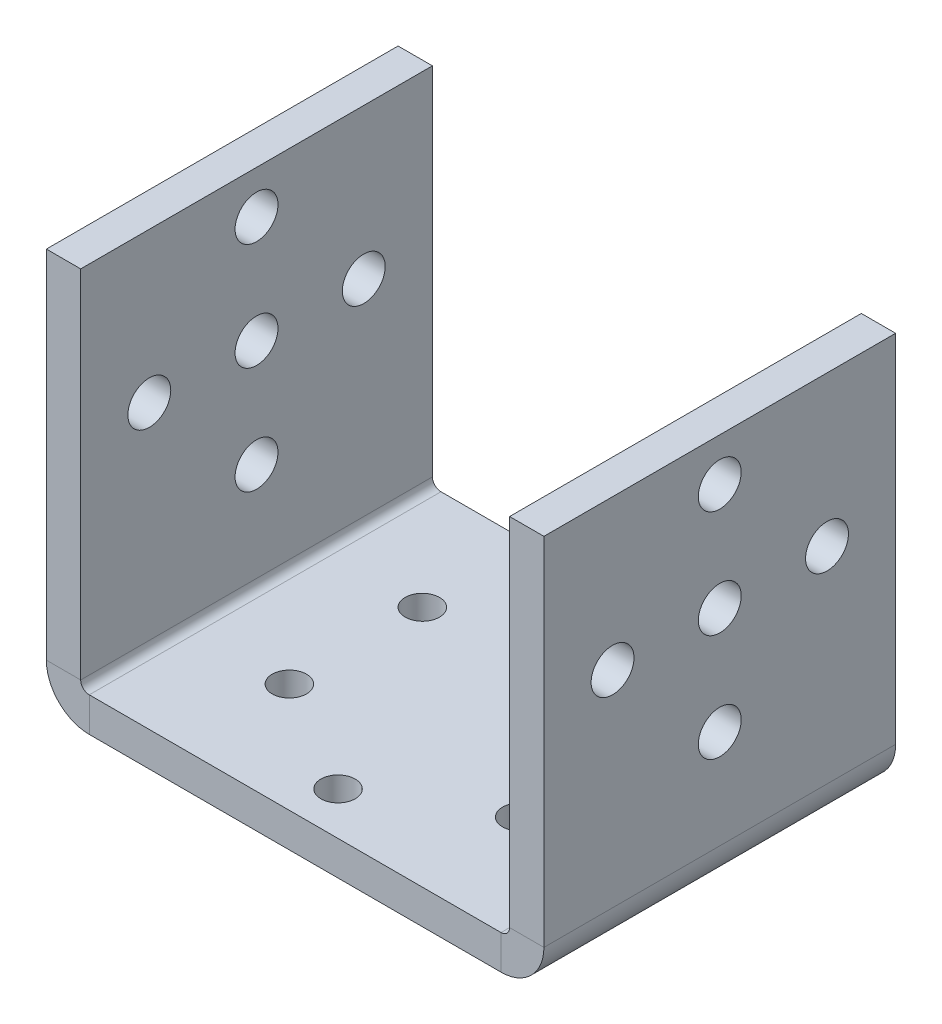
ISO-10303-21;
HEADER;
FILE_DESCRIPTION(('STEP AP214'),'2;1');
FILE_NAME('part.step','',(''),(''),'','','');
FILE_SCHEMA(('AUTOMOTIVE_DESIGN { 1 0 10303 214 1 1 1 1 }'));
ENDSEC;
DATA;
#1=APPLICATION_CONTEXT('core data for automotive mechanical design processes');
#2=APPLICATION_PROTOCOL_DEFINITION('international standard','automotive_design',2000,#1);
#3=PRODUCT_CONTEXT('',#1,'mechanical');
#4=PRODUCT('Part','Part','',(#3));
#5=PRODUCT_RELATED_PRODUCT_CATEGORY('part','',(#4));
#6=PRODUCT_DEFINITION_FORMATION('','',#4);
#7=PRODUCT_DEFINITION_CONTEXT('part definition',#1,'design');
#8=PRODUCT_DEFINITION('design','',#6,#7);
#9=PRODUCT_DEFINITION_SHAPE('','',#8);
#10=(LENGTH_UNIT() NAMED_UNIT(*) SI_UNIT(.MILLI.,.METRE.));
#11=(NAMED_UNIT(*) PLANE_ANGLE_UNIT() SI_UNIT($,.RADIAN.));
#12=(NAMED_UNIT(*) SI_UNIT($,.STERADIAN.) SOLID_ANGLE_UNIT());
#13=UNCERTAINTY_MEASURE_WITH_UNIT(LENGTH_MEASURE(1.E-05),#10,'distance_accuracy_value','');
#14=(GEOMETRIC_REPRESENTATION_CONTEXT(3) GLOBAL_UNCERTAINTY_ASSIGNED_CONTEXT((#13)) GLOBAL_UNIT_ASSIGNED_CONTEXT((#10,
#11,#12)) REPRESENTATION_CONTEXT('',''));
#15=CARTESIAN_POINT('',(0.,0.,0.));
#16=DIRECTION('',(0.,0.,1.));
#17=DIRECTION('',(1.,0.,0.));
#18=AXIS2_PLACEMENT_3D('',#15,#16,#17);
#19=CARTESIAN_POINT('',(25.,1.00000000000001,41.));
#20=DIRECTION('',(0.,0.,1.));
#21=DIRECTION('',(1.,0.,0.));
#22=AXIS2_PLACEMENT_3D('',#19,#20,#21);
#23=PLANE('',#22);
#24=DIRECTION('',(1.,0.,0.));
#25=VECTOR('',#24,1.);
#26=CARTESIAN_POINT('',(25.,1.00000000000001,41.));
#27=LINE('',#26,#25);
#28=CARTESIAN_POINT('',(25.,1.00000000000001,41.));
#29=VERTEX_POINT('',#28);
#30=CARTESIAN_POINT('',(29.,1.00000000000001,41.));
#31=VERTEX_POINT('',#30);
#32=EDGE_CURVE('E11',#29,#31,#27,.T.);
#33=ORIENTED_EDGE('',*,*,#32,.F.);
#34=CARTESIAN_POINT('',(24.,1.00000000000001,41.));
#35=DIRECTION('',(0.,0.,1.));
#36=DIRECTION('',(1.,0.,0.));
#37=AXIS2_PLACEMENT_3D('',#34,#35,#36);
#38=CIRCLE('',#37,1.);
#39=CARTESIAN_POINT('',(24.,0.,41.));
#40=VERTEX_POINT('',#39);
#41=EDGE_CURVE('E161',#29,#40,#38,.F.);
#42=ORIENTED_EDGE('',*,*,#41,.T.);
#43=DIRECTION('',(0.,1.,0.));
#44=VECTOR('',#43,1.);
#45=CARTESIAN_POINT('',(24.,-3.99999999999999,41.));
#46=LINE('',#45,#44);
#47=CARTESIAN_POINT('',(24.,-3.99999999999999,41.));
#48=VERTEX_POINT('',#47);
#49=EDGE_CURVE('E56',#48,#40,#46,.T.);
#50=ORIENTED_EDGE('',*,*,#49,.F.);
#51=CARTESIAN_POINT('',(24.,1.00000000000001,41.));
#52=DIRECTION('',(0.,0.,1.));
#53=DIRECTION('',(1.,0.,0.));
#54=AXIS2_PLACEMENT_3D('',#51,#52,#53);
#55=CIRCLE('',#54,5.);
#56=EDGE_CURVE('E401',#31,#48,#55,.F.);
#57=ORIENTED_EDGE('',*,*,#56,.F.);
#58=EDGE_LOOP('',(#33,#42,#50,#57));
#59=FACE_BOUND('',#58,.T.);
#60=ADVANCED_FACE('F46',(#59),#23,.T.);
#61=CARTESIAN_POINT('',(24.,-3.99999999999999,41.));
#62=DIRECTION('',(0.,0.,1.));
#63=DIRECTION('',(1.,0.,0.));
#64=AXIS2_PLACEMENT_3D('',#61,#62,#63);
#65=PLANE('',#64);
#66=DIRECTION('',(0.,-1.,0.));
#67=VECTOR('',#66,1.);
#68=CARTESIAN_POINT('',(25.,0.,41.));
#69=LINE('',#68,#67);
#70=CARTESIAN_POINT('',(25.,42.5,41.));
#71=VERTEX_POINT('',#70);
#72=EDGE_CURVE('E167',#71,#29,#69,.T.);
#73=ORIENTED_EDGE('',*,*,#72,.T.);
#74=ORIENTED_EDGE('',*,*,#32,.T.);
#75=DIRECTION('',(0.,1.,0.));
#76=VECTOR('',#75,1.);
#77=CARTESIAN_POINT('',(29.,0.,41.));
#78=LINE('',#77,#76);
#79=CARTESIAN_POINT('',(29.,42.5,41.));
#80=VERTEX_POINT('',#79);
#81=EDGE_CURVE('E404',#80,#31,#78,.F.);
#82=ORIENTED_EDGE('',*,*,#81,.F.);
#83=DIRECTION('',(1.,0.,0.));
#84=VECTOR('',#83,1.);
#85=CARTESIAN_POINT('',(25.,42.5,41.));
#86=LINE('',#85,#84);
#87=EDGE_CURVE('E408',#71,#80,#86,.T.);
#88=ORIENTED_EDGE('',*,*,#87,.F.);
#89=EDGE_LOOP('',(#73,#74,#82,#88));
#90=FACE_BOUND('',#89,.T.);
#91=ADVANCED_FACE('F418',(#90),#65,.T.);
#92=CARTESIAN_POINT('',(24.,0.,0.));
#93=DIRECTION('',(0.,0.,-1.));
#94=DIRECTION('',(-1.,0.,0.));
#95=AXIS2_PLACEMENT_3D('',#92,#93,#94);
#96=PLANE('',#95);
#97=DIRECTION('',(0.,-1.,0.));
#98=VECTOR('',#97,1.);
#99=CARTESIAN_POINT('',(24.,0.,0.));
#100=LINE('',#99,#98);
#101=CARTESIAN_POINT('',(24.,0.,0.));
#102=VERTEX_POINT('',#101);
#103=CARTESIAN_POINT('',(24.,-3.99999999999999,0.));
#104=VERTEX_POINT('',#103);
#105=EDGE_CURVE('E158',#102,#104,#100,.T.);
#106=ORIENTED_EDGE('',*,*,#105,.F.);
#107=CARTESIAN_POINT('',(24.,1.00000000000001,0.));
#108=DIRECTION('',(0.,0.,1.));
#109=DIRECTION('',(1.,0.,0.));
#110=AXIS2_PLACEMENT_3D('',#107,#108,#109);
#111=CIRCLE('',#110,1.);
#112=CARTESIAN_POINT('',(25.,1.00000000000001,0.));
#113=VERTEX_POINT('',#112);
#114=EDGE_CURVE('E174',#113,#102,#111,.F.);
#115=ORIENTED_EDGE('',*,*,#114,.F.);
#116=DIRECTION('',(-1.,0.,0.));
#117=VECTOR('',#116,1.);
#118=CARTESIAN_POINT('',(29.,1.00000000000001,0.));
#119=LINE('',#118,#117);
#120=CARTESIAN_POINT('',(29.,1.00000000000001,0.));
#121=VERTEX_POINT('',#120);
#122=EDGE_CURVE('E280',#121,#113,#119,.T.);
#123=ORIENTED_EDGE('',*,*,#122,.F.);
#124=CARTESIAN_POINT('',(24.,1.00000000000001,0.));
#125=DIRECTION('',(0.,0.,1.));
#126=DIRECTION('',(1.,0.,0.));
#127=AXIS2_PLACEMENT_3D('',#124,#125,#126);
#128=CIRCLE('',#127,5.);
#129=EDGE_CURVE('E212',#121,#104,#128,.F.);
#130=ORIENTED_EDGE('',*,*,#129,.T.);
#131=EDGE_LOOP('',(#106,#115,#123,#130));
#132=FACE_BOUND('',#131,.T.);
#133=ADVANCED_FACE('F425',(#132),#96,.T.);
#134=CARTESIAN_POINT('',(29.,1.00000000000001,0.));
#135=DIRECTION('',(0.,0.,-1.));
#136=DIRECTION('',(-1.,0.,0.));
#137=AXIS2_PLACEMENT_3D('',#134,#135,#136);
#138=PLANE('',#137);
#139=DIRECTION('',(-1.,0.,0.));
#140=VECTOR('',#139,1.);
#141=CARTESIAN_POINT('',(-25.,0.,0.));
#142=LINE('',#141,#140);
#143=CARTESIAN_POINT('',(-24.,0.,0.));
#144=VERTEX_POINT('',#143);
#145=EDGE_CURVE('E230',#102,#144,#142,.T.);
#146=ORIENTED_EDGE('',*,*,#145,.F.);
#147=ORIENTED_EDGE('',*,*,#105,.T.);
#148=DIRECTION('',(-1.,0.,0.));
#149=VECTOR('',#148,1.);
#150=CARTESIAN_POINT('',(-25.,-4.,0.));
#151=LINE('',#150,#149);
#152=CARTESIAN_POINT('',(-24.,-4.,0.));
#153=VERTEX_POINT('',#152);
#154=EDGE_CURVE('E209',#104,#153,#151,.T.);
#155=ORIENTED_EDGE('',*,*,#154,.T.);
#156=DIRECTION('',(0.,1.,0.));
#157=VECTOR('',#156,1.);
#158=CARTESIAN_POINT('',(-24.,-4.,0.));
#159=LINE('',#158,#157);
#160=EDGE_CURVE('E106',#153,#144,#159,.T.);
#161=ORIENTED_EDGE('',*,*,#160,.T.);
#162=EDGE_LOOP('',(#146,#147,#155,#161));
#163=FACE_BOUND('',#162,.T.);
#164=ADVANCED_FACE('F427',(#163),#138,.T.);
#165=CARTESIAN_POINT('',(-24.,0.,41.));
#166=DIRECTION('',(0.,0.,1.));
#167=DIRECTION('',(1.,0.,0.));
#168=AXIS2_PLACEMENT_3D('',#165,#166,#167);
#169=PLANE('',#168);
#170=DIRECTION('',(0.,-1.,0.));
#171=VECTOR('',#170,1.);
#172=CARTESIAN_POINT('',(-24.,0.,41.));
#173=LINE('',#172,#171);
#174=CARTESIAN_POINT('',(-24.,0.,41.));
#175=VERTEX_POINT('',#174);
#176=CARTESIAN_POINT('',(-24.,-4.,41.));
#177=VERTEX_POINT('',#176);
#178=EDGE_CURVE('E277',#175,#177,#173,.T.);
#179=ORIENTED_EDGE('',*,*,#178,.F.);
#180=CARTESIAN_POINT('',(-24.,1.,41.));
#181=DIRECTION('',(0.,0.,1.));
#182=DIRECTION('',(1.,0.,0.));
#183=AXIS2_PLACEMENT_3D('',#180,#181,#182);
#184=CIRCLE('',#183,1.);
#185=CARTESIAN_POINT('',(-25.,1.,41.));
#186=VERTEX_POINT('',#185);
#187=EDGE_CURVE('E184',#175,#186,#184,.F.);
#188=ORIENTED_EDGE('',*,*,#187,.T.);
#189=DIRECTION('',(1.,0.,0.));
#190=VECTOR('',#189,1.);
#191=CARTESIAN_POINT('',(-29.,1.,41.));
#192=LINE('',#191,#190);
#193=CARTESIAN_POINT('',(-29.,1.,41.));
#194=VERTEX_POINT('',#193);
#195=EDGE_CURVE('E65',#194,#186,#192,.T.);
#196=ORIENTED_EDGE('',*,*,#195,.F.);
#197=CARTESIAN_POINT('',(-24.,1.,41.));
#198=DIRECTION('',(0.,0.,1.));
#199=DIRECTION('',(1.,0.,0.));
#200=AXIS2_PLACEMENT_3D('',#197,#198,#199);
#201=CIRCLE('',#200,5.);
#202=EDGE_CURVE('E395',#177,#194,#201,.F.);
#203=ORIENTED_EDGE('',*,*,#202,.F.);
#204=EDGE_LOOP('',(#179,#188,#196,#203));
#205=FACE_BOUND('',#204,.T.);
#206=ADVANCED_FACE('F477',(#205),#169,.T.);
#207=CARTESIAN_POINT('',(-29.,1.,41.));
#208=DIRECTION('',(0.,0.,1.));
#209=DIRECTION('',(1.,0.,0.));
#210=AXIS2_PLACEMENT_3D('',#207,#208,#209);
#211=PLANE('',#210);
#212=DIRECTION('',(-1.,0.,0.));
#213=VECTOR('',#212,1.);
#214=CARTESIAN_POINT('',(-25.,0.,41.));
#215=LINE('',#214,#213);
#216=EDGE_CURVE('E149',#40,#175,#215,.T.);
#217=ORIENTED_EDGE('',*,*,#216,.T.);
#218=ORIENTED_EDGE('',*,*,#178,.T.);
#219=DIRECTION('',(-1.,0.,0.));
#220=VECTOR('',#219,1.);
#221=CARTESIAN_POINT('',(-25.,-4.,41.));
#222=LINE('',#221,#220);
#223=EDGE_CURVE('E152',#48,#177,#222,.T.);
#224=ORIENTED_EDGE('',*,*,#223,.F.);
#225=ORIENTED_EDGE('',*,*,#49,.T.);
#226=EDGE_LOOP('',(#217,#218,#224,#225));
#227=FACE_BOUND('',#226,.T.);
#228=ADVANCED_FACE('F147',(#227),#211,.T.);
#229=CARTESIAN_POINT('',(-25.,1.,0.));
#230=DIRECTION('',(0.,0.,-1.));
#231=DIRECTION('',(-1.,0.,0.));
#232=AXIS2_PLACEMENT_3D('',#229,#230,#231);
#233=PLANE('',#232);
#234=DIRECTION('',(-1.,0.,0.));
#235=VECTOR('',#234,1.);
#236=CARTESIAN_POINT('',(-25.,1.,0.));
#237=LINE('',#236,#235);
#238=CARTESIAN_POINT('',(-25.,1.,0.));
#239=VERTEX_POINT('',#238);
#240=CARTESIAN_POINT('',(-29.,1.,0.));
#241=VERTEX_POINT('',#240);
#242=EDGE_CURVE('E113',#239,#241,#237,.T.);
#243=ORIENTED_EDGE('',*,*,#242,.F.);
#244=CARTESIAN_POINT('',(-24.,1.,0.));
#245=DIRECTION('',(0.,0.,1.));
#246=DIRECTION('',(1.,0.,0.));
#247=AXIS2_PLACEMENT_3D('',#244,#245,#246);
#248=CIRCLE('',#247,1.);
#249=EDGE_CURVE('E233',#144,#239,#248,.F.);
#250=ORIENTED_EDGE('',*,*,#249,.F.);
#251=ORIENTED_EDGE('',*,*,#160,.F.);
#252=CARTESIAN_POINT('',(-24.,1.,0.));
#253=DIRECTION('',(0.,0.,1.));
#254=DIRECTION('',(1.,0.,0.));
#255=AXIS2_PLACEMENT_3D('',#252,#253,#254);
#256=CIRCLE('',#255,5.);
#257=EDGE_CURVE('E206',#153,#241,#256,.F.);
#258=ORIENTED_EDGE('',*,*,#257,.T.);
#259=EDGE_LOOP('',(#243,#250,#251,#258));
#260=FACE_BOUND('',#259,.T.);
#261=ADVANCED_FACE('F440',(#260),#233,.T.);
#262=CARTESIAN_POINT('',(-24.,-4.,0.));
#263=DIRECTION('',(0.,0.,-1.));
#264=DIRECTION('',(-1.,0.,0.));
#265=AXIS2_PLACEMENT_3D('',#262,#263,#264);
#266=PLANE('',#265);
#267=DIRECTION('',(0.,1.,0.));
#268=VECTOR('',#267,1.);
#269=CARTESIAN_POINT('',(-25.,0.,0.));
#270=LINE('',#269,#268);
#271=CARTESIAN_POINT('',(-25.,42.5,0.));
#272=VERTEX_POINT('',#271);
#273=EDGE_CURVE('E193',#239,#272,#270,.T.);
#274=ORIENTED_EDGE('',*,*,#273,.F.);
#275=ORIENTED_EDGE('',*,*,#242,.T.);
#276=DIRECTION('',(0.,1.,0.));
#277=VECTOR('',#276,1.);
#278=CARTESIAN_POINT('',(-29.,0.,0.));
#279=LINE('',#278,#277);
#280=CARTESIAN_POINT('',(-29.,42.5,0.));
#281=VERTEX_POINT('',#280);
#282=EDGE_CURVE('E202',#241,#281,#279,.T.);
#283=ORIENTED_EDGE('',*,*,#282,.T.);
#284=DIRECTION('',(1.,0.,0.));
#285=VECTOR('',#284,1.);
#286=CARTESIAN_POINT('',(-29.,42.5,0.));
#287=LINE('',#286,#285);
#288=EDGE_CURVE('E197',#281,#272,#287,.T.);
#289=ORIENTED_EDGE('',*,*,#288,.T.);
#290=EDGE_LOOP('',(#274,#275,#283,#289));
#291=FACE_BOUND('',#290,.T.);
#292=ADVANCED_FACE('F448',(#291),#266,.T.);
#293=CARTESIAN_POINT('',(-25.,0.,41.));
#294=DIRECTION('',(-1.,0.,0.));
#295=DIRECTION('',(0.,0.,1.));
#296=AXIS2_PLACEMENT_3D('',#293,#294,#295);
#297=PLANE('',#296);
#298=CARTESIAN_POINT('',(-25.,37.5,20.5));
#299=DIRECTION('',(-1.,0.,0.));
#300=DIRECTION('',(0.,0.,1.));
#301=AXIS2_PLACEMENT_3D('',#298,#299,#300);
#302=CIRCLE('',#301,2.5);
#303=CARTESIAN_POINT('',(-25.,37.5,23.));
#304=VERTEX_POINT('',#303);
#305=EDGE_CURVE('E358',#304,#304,#302,.T.);
#306=ORIENTED_EDGE('',*,*,#305,.T.);
#307=EDGE_LOOP('',(#306));
#308=FACE_BOUND('',#307,.T.);
#309=CARTESIAN_POINT('',(-25.,25.,8.));
#310=DIRECTION('',(-1.,0.,0.));
#311=DIRECTION('',(0.,0.,1.));
#312=AXIS2_PLACEMENT_3D('',#309,#310,#311);
#313=CIRCLE('',#312,2.5);
#314=CARTESIAN_POINT('',(-25.,25.,10.5));
#315=VERTEX_POINT('',#314);
#316=EDGE_CURVE('E338',#315,#315,#313,.T.);
#317=ORIENTED_EDGE('',*,*,#316,.T.);
#318=EDGE_LOOP('',(#317));
#319=FACE_BOUND('',#318,.T.);
#320=CARTESIAN_POINT('',(-25.,25.,20.5));
#321=DIRECTION('',(-1.,0.,0.));
#322=DIRECTION('',(0.,0.,1.));
#323=AXIS2_PLACEMENT_3D('',#320,#321,#322);
#324=CIRCLE('',#323,2.5);
#325=CARTESIAN_POINT('',(-25.,25.,23.));
#326=VERTEX_POINT('',#325);
#327=EDGE_CURVE('E330',#326,#326,#324,.T.);
#328=ORIENTED_EDGE('',*,*,#327,.T.);
#329=EDGE_LOOP('',(#328));
#330=FACE_BOUND('',#329,.T.);
#331=CARTESIAN_POINT('',(-25.,25.,33.));
#332=DIRECTION('',(-1.,0.,0.));
#333=DIRECTION('',(0.,0.,1.));
#334=AXIS2_PLACEMENT_3D('',#331,#332,#333);
#335=CIRCLE('',#334,2.5);
#336=CARTESIAN_POINT('',(-25.,25.,35.5));
#337=VERTEX_POINT('',#336);
#338=EDGE_CURVE('E325',#337,#337,#335,.T.);
#339=ORIENTED_EDGE('',*,*,#338,.T.);
#340=EDGE_LOOP('',(#339));
#341=FACE_BOUND('',#340,.T.);
#342=CARTESIAN_POINT('',(-25.,12.5,20.5));
#343=DIRECTION('',(-1.,0.,0.));
#344=DIRECTION('',(0.,0.,1.));
#345=AXIS2_PLACEMENT_3D('',#342,#343,#344);
#346=CIRCLE('',#345,2.5);
#347=CARTESIAN_POINT('',(-25.,12.5,23.));
#348=VERTEX_POINT('',#347);
#349=EDGE_CURVE('E320',#348,#348,#346,.T.);
#350=ORIENTED_EDGE('',*,*,#349,.T.);
#351=EDGE_LOOP('',(#350));
#352=FACE_BOUND('',#351,.T.);
#353=ORIENTED_EDGE('',*,*,#273,.T.);
#354=DIRECTION('',(0.,0.,-1.));
#355=VECTOR('',#354,1.);
#356=CARTESIAN_POINT('',(-25.,42.5,41.));
#357=LINE('',#356,#355);
#358=CARTESIAN_POINT('',(-25.,42.5,41.));
#359=VERTEX_POINT('',#358);
#360=EDGE_CURVE('E268',#359,#272,#357,.T.);
#361=ORIENTED_EDGE('',*,*,#360,.F.);
#362=DIRECTION('',(0.,1.,0.));
#363=VECTOR('',#362,1.);
#364=CARTESIAN_POINT('',(-25.,0.,41.));
#365=LINE('',#364,#363);
#366=EDGE_CURVE('E119',#186,#359,#365,.T.);
#367=ORIENTED_EDGE('',*,*,#366,.F.);
#368=DIRECTION('',(0.,0.,-1.));
#369=VECTOR('',#368,1.);
#370=CARTESIAN_POINT('',(-25.,1.,41.));
#371=LINE('',#370,#369);
#372=EDGE_CURVE('E189',#186,#239,#371,.T.);
#373=ORIENTED_EDGE('',*,*,#372,.T.);
#374=EDGE_LOOP('',(#353,#361,#367,#373));
#375=FACE_BOUND('',#374,.T.);
#376=ADVANCED_FACE('F446',(#308,#319,#330,#341,#352,#375),#297,.F.);
#377=CARTESIAN_POINT('',(-29.,42.5,41.));
#378=DIRECTION('',(0.,1.,0.));
#379=DIRECTION('',(0.,0.,1.));
#380=AXIS2_PLACEMENT_3D('',#377,#378,#379);
#381=PLANE('',#380);
#382=ORIENTED_EDGE('',*,*,#288,.F.);
#383=DIRECTION('',(0.,0.,-1.));
#384=VECTOR('',#383,1.);
#385=CARTESIAN_POINT('',(-29.,42.5,41.));
#386=LINE('',#385,#384);
#387=CARTESIAN_POINT('',(-29.,42.5,41.));
#388=VERTEX_POINT('',#387);
#389=EDGE_CURVE('E265',#388,#281,#386,.T.);
#390=ORIENTED_EDGE('',*,*,#389,.F.);
#391=DIRECTION('',(1.,0.,0.));
#392=VECTOR('',#391,1.);
#393=CARTESIAN_POINT('',(-29.,42.5,41.));
#394=LINE('',#393,#392);
#395=EDGE_CURVE('E387',#388,#359,#394,.T.);
#396=ORIENTED_EDGE('',*,*,#395,.T.);
#397=ORIENTED_EDGE('',*,*,#360,.T.);
#398=EDGE_LOOP('',(#382,#390,#396,#397));
#399=FACE_BOUND('',#398,.T.);
#400=ADVANCED_FACE('F451',(#399),#381,.T.);
#401=CARTESIAN_POINT('',(-29.,0.,41.));
#402=DIRECTION('',(-1.,0.,0.));
#403=DIRECTION('',(0.,0.,1.));
#404=AXIS2_PLACEMENT_3D('',#401,#402,#403);
#405=PLANE('',#404);
#406=CARTESIAN_POINT('',(-29.,37.5,20.5));
#407=DIRECTION('',(1.,0.,0.));
#408=DIRECTION('',(0.,0.,-1.));
#409=AXIS2_PLACEMENT_3D('',#406,#407,#408);
#410=CIRCLE('',#409,2.5);
#411=CARTESIAN_POINT('',(-29.,37.5,18.));
#412=VERTEX_POINT('',#411);
#413=EDGE_CURVE('E314',#412,#412,#410,.T.);
#414=ORIENTED_EDGE('',*,*,#413,.T.);
#415=EDGE_LOOP('',(#414));
#416=FACE_BOUND('',#415,.T.);
#417=CARTESIAN_POINT('',(-29.,25.,8.));
#418=DIRECTION('',(1.,0.,0.));
#419=DIRECTION('',(0.,0.,-1.));
#420=AXIS2_PLACEMENT_3D('',#417,#418,#419);
#421=CIRCLE('',#420,2.5);
#422=CARTESIAN_POINT('',(-29.,25.,5.5));
#423=VERTEX_POINT('',#422);
#424=EDGE_CURVE('E545',#423,#423,#421,.T.);
#425=ORIENTED_EDGE('',*,*,#424,.T.);
#426=EDGE_LOOP('',(#425));
#427=FACE_BOUND('',#426,.T.);
#428=CARTESIAN_POINT('',(-29.,25.,20.5));
#429=DIRECTION('',(1.,0.,0.));
#430=DIRECTION('',(0.,0.,-1.));
#431=AXIS2_PLACEMENT_3D('',#428,#429,#430);
#432=CIRCLE('',#431,2.5);
#433=CARTESIAN_POINT('',(-29.,25.,18.));
#434=VERTEX_POINT('',#433);
#435=EDGE_CURVE('E540',#434,#434,#432,.T.);
#436=ORIENTED_EDGE('',*,*,#435,.T.);
#437=EDGE_LOOP('',(#436));
#438=FACE_BOUND('',#437,.T.);
#439=CARTESIAN_POINT('',(-29.,25.,33.));
#440=DIRECTION('',(1.,0.,0.));
#441=DIRECTION('',(0.,0.,-1.));
#442=AXIS2_PLACEMENT_3D('',#439,#440,#441);
#443=CIRCLE('',#442,2.5);
#444=CARTESIAN_POINT('',(-29.,25.,30.5));
#445=VERTEX_POINT('',#444);
#446=EDGE_CURVE('E534',#445,#445,#443,.T.);
#447=ORIENTED_EDGE('',*,*,#446,.T.);
#448=EDGE_LOOP('',(#447));
#449=FACE_BOUND('',#448,.T.);
#450=CARTESIAN_POINT('',(-29.,12.5,20.5));
#451=DIRECTION('',(1.,0.,0.));
#452=DIRECTION('',(0.,0.,-1.));
#453=AXIS2_PLACEMENT_3D('',#450,#451,#452);
#454=CIRCLE('',#453,2.5);
#455=CARTESIAN_POINT('',(-29.,12.5,18.));
#456=VERTEX_POINT('',#455);
#457=EDGE_CURVE('E528',#456,#456,#454,.T.);
#458=ORIENTED_EDGE('',*,*,#457,.T.);
#459=EDGE_LOOP('',(#458));
#460=FACE_BOUND('',#459,.T.);
#461=ORIENTED_EDGE('',*,*,#282,.F.);
#462=DIRECTION('',(0.,0.,-1.));
#463=VECTOR('',#462,1.);
#464=CARTESIAN_POINT('',(-29.,1.,41.));
#465=LINE('',#464,#463);
#466=EDGE_CURVE('E261',#194,#241,#465,.T.);
#467=ORIENTED_EDGE('',*,*,#466,.F.);
#468=DIRECTION('',(0.,1.,0.));
#469=VECTOR('',#468,1.);
#470=CARTESIAN_POINT('',(-29.,0.,41.));
#471=LINE('',#470,#469);
#472=EDGE_CURVE('E391',#194,#388,#471,.T.);
#473=ORIENTED_EDGE('',*,*,#472,.T.);
#474=ORIENTED_EDGE('',*,*,#389,.T.);
#475=EDGE_LOOP('',(#461,#467,#473,#474));
#476=FACE_BOUND('',#475,.T.);
#477=ADVANCED_FACE('F454',(#416,#427,#438,#449,#460,#476),#405,.T.);
#478=CARTESIAN_POINT('',(-24.,1.,41.));
#479=DIRECTION('',(0.,0.,-1.));
#480=DIRECTION('',(-1.,0.,0.));
#481=AXIS2_PLACEMENT_3D('',#478,#479,#480);
#482=CYLINDRICAL_SURFACE('',#481,5.);
#483=ORIENTED_EDGE('',*,*,#257,.F.);
#484=DIRECTION('',(0.,0.,-1.));
#485=VECTOR('',#484,1.);
#486=CARTESIAN_POINT('',(-24.,-4.,41.));
#487=LINE('',#486,#485);
#488=EDGE_CURVE('E257',#177,#153,#487,.T.);
#489=ORIENTED_EDGE('',*,*,#488,.F.);
#490=ORIENTED_EDGE('',*,*,#202,.T.);
#491=ORIENTED_EDGE('',*,*,#466,.T.);
#492=EDGE_LOOP('',(#483,#489,#490,#491));
#493=FACE_BOUND('',#492,.T.);
#494=ADVANCED_FACE('F437',(#493),#482,.T.);
#495=CARTESIAN_POINT('',(-25.,-4.,41.));
#496=DIRECTION('',(0.,-1.,0.));
#497=DIRECTION('',(1.,0.,0.));
#498=AXIS2_PLACEMENT_3D('',#495,#496,#497);
#499=PLANE('',#498);
#500=CARTESIAN_POINT('',(-13.4233937586588,-4.,12.75));
#501=DIRECTION('',(0.,-1.,0.));
#502=DIRECTION('',(1.,0.,0.));
#503=AXIS2_PLACEMENT_3D('',#500,#501,#502);
#504=CIRCLE('',#503,1.99999999999997);
#505=CARTESIAN_POINT('',(-11.4233937586588,-4.,12.75));
#506=VERTEX_POINT('',#505);
#507=EDGE_CURVE('E362',#506,#506,#504,.T.);
#508=ORIENTED_EDGE('',*,*,#507,.F.);
#509=EDGE_LOOP('',(#508));
#510=FACE_BOUND('',#509,.T.);
#511=CARTESIAN_POINT('',(0.,-4.,5.));
#512=DIRECTION('',(0.,-1.,0.));
#513=DIRECTION('',(1.,0.,0.));
#514=AXIS2_PLACEMENT_3D('',#511,#512,#513);
#515=CIRCLE('',#514,2.00000000000001);
#516=CARTESIAN_POINT('',(2.00000000000001,-4.,5.));
#517=VERTEX_POINT('',#516);
#518=EDGE_CURVE('E375',#517,#517,#515,.T.);
#519=ORIENTED_EDGE('',*,*,#518,.F.);
#520=EDGE_LOOP('',(#519));
#521=FACE_BOUND('',#520,.T.);
#522=CARTESIAN_POINT('',(13.4233937586588,-3.99999999999999,12.75));
#523=DIRECTION('',(0.,-1.,0.));
#524=DIRECTION('',(1.,0.,0.));
#525=AXIS2_PLACEMENT_3D('',#522,#523,#524);
#526=CIRCLE('',#525,2.);
#527=CARTESIAN_POINT('',(15.4233937586588,-3.99999999999999,12.75));
#528=VERTEX_POINT('',#527);
#529=EDGE_CURVE('E371',#528,#528,#526,.T.);
#530=ORIENTED_EDGE('',*,*,#529,.F.);
#531=EDGE_LOOP('',(#530));
#532=FACE_BOUND('',#531,.T.);
#533=CARTESIAN_POINT('',(13.4233937586588,-3.99999999999999,28.25));
#534=DIRECTION('',(0.,-1.,0.));
#535=DIRECTION('',(1.,0.,0.));
#536=AXIS2_PLACEMENT_3D('',#533,#534,#535);
#537=CIRCLE('',#536,2.);
#538=CARTESIAN_POINT('',(15.4233937586588,-3.99999999999999,28.25));
#539=VERTEX_POINT('',#538);
#540=EDGE_CURVE('E367',#539,#539,#537,.T.);
#541=ORIENTED_EDGE('',*,*,#540,.F.);
#542=EDGE_LOOP('',(#541));
#543=FACE_BOUND('',#542,.T.);
#544=CARTESIAN_POINT('',(0.,-4.,36.));
#545=DIRECTION('',(0.,-1.,0.));
#546=DIRECTION('',(1.,0.,0.));
#547=AXIS2_PLACEMENT_3D('',#544,#545,#546);
#548=CIRCLE('',#547,2.);
#549=CARTESIAN_POINT('',(2.,-4.,36.));
#550=VERTEX_POINT('',#549);
#551=EDGE_CURVE('E363',#550,#550,#548,.T.);
#552=ORIENTED_EDGE('',*,*,#551,.F.);
#553=EDGE_LOOP('',(#552));
#554=FACE_BOUND('',#553,.T.);
#555=CARTESIAN_POINT('',(-13.4233937586588,-4.,28.25));
#556=DIRECTION('',(0.,-1.,0.));
#557=DIRECTION('',(1.,0.,0.));
#558=AXIS2_PLACEMENT_3D('',#555,#556,#557);
#559=CIRCLE('',#558,2.);
#560=CARTESIAN_POINT('',(-11.4233937586588,-4.,28.25));
#561=VERTEX_POINT('',#560);
#562=EDGE_CURVE('E290',#561,#561,#559,.T.);
#563=ORIENTED_EDGE('',*,*,#562,.F.);
#564=EDGE_LOOP('',(#563));
#565=FACE_BOUND('',#564,.T.);
#566=ORIENTED_EDGE('',*,*,#154,.F.);
#567=DIRECTION('',(0.,0.,-1.));
#568=VECTOR('',#567,1.);
#569=CARTESIAN_POINT('',(24.,-3.99999999999999,41.));
#570=LINE('',#569,#568);
#571=EDGE_CURVE('E253',#48,#104,#570,.T.);
#572=ORIENTED_EDGE('',*,*,#571,.F.);
#573=ORIENTED_EDGE('',*,*,#223,.T.);
#574=ORIENTED_EDGE('',*,*,#488,.T.);
#575=EDGE_LOOP('',(#566,#572,#573,#574));
#576=FACE_BOUND('',#575,.T.);
#577=ADVANCED_FACE('F432',(#510,#521,#532,#543,#554,#565,#576),#499,.T.);
#578=CARTESIAN_POINT('',(24.,1.00000000000001,41.));
#579=DIRECTION('',(0.,0.,-1.));
#580=DIRECTION('',(-1.,0.,0.));
#581=AXIS2_PLACEMENT_3D('',#578,#579,#580);
#582=CYLINDRICAL_SURFACE('',#581,5.);
#583=ORIENTED_EDGE('',*,*,#129,.F.);
#584=DIRECTION('',(0.,0.,-1.));
#585=VECTOR('',#584,1.);
#586=CARTESIAN_POINT('',(29.,1.00000000000001,41.));
#587=LINE('',#586,#585);
#588=EDGE_CURVE('E249',#31,#121,#587,.T.);
#589=ORIENTED_EDGE('',*,*,#588,.F.);
#590=ORIENTED_EDGE('',*,*,#56,.T.);
#591=ORIENTED_EDGE('',*,*,#571,.T.);
#592=EDGE_LOOP('',(#583,#589,#590,#591));
#593=FACE_BOUND('',#592,.T.);
#594=ADVANCED_FACE('F430',(#593),#582,.T.);
#595=CARTESIAN_POINT('',(29.,0.,41.));
#596=DIRECTION('',(1.,0.,0.));
#597=DIRECTION('',(0.,0.,-1.));
#598=AXIS2_PLACEMENT_3D('',#595,#596,#597);
#599=PLANE('',#598);
#600=CARTESIAN_POINT('',(29.,37.5,20.5));
#601=DIRECTION('',(1.,0.,0.));
#602=DIRECTION('',(0.,0.,-1.));
#603=AXIS2_PLACEMENT_3D('',#600,#601,#602);
#604=CIRCLE('',#603,2.5);
#605=CARTESIAN_POINT('',(29.,37.5,18.));
#606=VERTEX_POINT('',#605);
#607=EDGE_CURVE('E354',#606,#606,#604,.T.);
#608=ORIENTED_EDGE('',*,*,#607,.F.);
#609=EDGE_LOOP('',(#608));
#610=FACE_BOUND('',#609,.T.);
#611=CARTESIAN_POINT('',(29.,25.,8.));
#612=DIRECTION('',(1.,0.,0.));
#613=DIRECTION('',(0.,0.,-1.));
#614=AXIS2_PLACEMENT_3D('',#611,#612,#613);
#615=CIRCLE('',#614,2.5);
#616=CARTESIAN_POINT('',(29.,25.,5.5));
#617=VERTEX_POINT('',#616);
#618=EDGE_CURVE('E329',#617,#617,#615,.T.);
#619=ORIENTED_EDGE('',*,*,#618,.F.);
#620=EDGE_LOOP('',(#619));
#621=FACE_BOUND('',#620,.T.);
#622=CARTESIAN_POINT('',(29.,25.,20.5));
#623=DIRECTION('',(1.,0.,0.));
#624=DIRECTION('',(0.,0.,-1.));
#625=AXIS2_PLACEMENT_3D('',#622,#623,#624);
#626=CIRCLE('',#625,2.5);
#627=CARTESIAN_POINT('',(29.,25.,18.));
#628=VERTEX_POINT('',#627);
#629=EDGE_CURVE('E324',#628,#628,#626,.T.);
#630=ORIENTED_EDGE('',*,*,#629,.F.);
#631=EDGE_LOOP('',(#630));
#632=FACE_BOUND('',#631,.T.);
#633=CARTESIAN_POINT('',(29.,25.,33.));
#634=DIRECTION('',(1.,0.,0.));
#635=DIRECTION('',(0.,0.,-1.));
#636=AXIS2_PLACEMENT_3D('',#633,#634,#635);
#637=CIRCLE('',#636,2.5);
#638=CARTESIAN_POINT('',(29.,25.,30.5));
#639=VERTEX_POINT('',#638);
#640=EDGE_CURVE('E319',#639,#639,#637,.T.);
#641=ORIENTED_EDGE('',*,*,#640,.F.);
#642=EDGE_LOOP('',(#641));
#643=FACE_BOUND('',#642,.T.);
#644=CARTESIAN_POINT('',(29.,12.5,20.5));
#645=DIRECTION('',(1.,0.,0.));
#646=DIRECTION('',(0.,0.,-1.));
#647=AXIS2_PLACEMENT_3D('',#644,#645,#646);
#648=CIRCLE('',#647,2.5);
#649=CARTESIAN_POINT('',(29.,12.5,18.));
#650=VERTEX_POINT('',#649);
#651=EDGE_CURVE('E313',#650,#650,#648,.T.);
#652=ORIENTED_EDGE('',*,*,#651,.F.);
#653=EDGE_LOOP('',(#652));
#654=FACE_BOUND('',#653,.T.);
#655=DIRECTION('',(0.,1.,0.));
#656=VECTOR('',#655,1.);
#657=CARTESIAN_POINT('',(29.,0.,0.));
#658=LINE('',#657,#656);
#659=CARTESIAN_POINT('',(29.,42.5,0.));
#660=VERTEX_POINT('',#659);
#661=EDGE_CURVE('E216',#660,#121,#658,.F.);
#662=ORIENTED_EDGE('',*,*,#661,.F.);
#663=DIRECTION('',(0.,0.,-1.));
#664=VECTOR('',#663,1.);
#665=CARTESIAN_POINT('',(29.,42.5,41.));
#666=LINE('',#665,#664);
#667=EDGE_CURVE('E246',#80,#660,#666,.T.);
#668=ORIENTED_EDGE('',*,*,#667,.F.);
#669=ORIENTED_EDGE('',*,*,#81,.T.);
#670=ORIENTED_EDGE('',*,*,#588,.T.);
#671=EDGE_LOOP('',(#662,#668,#669,#670));
#672=FACE_BOUND('',#671,.T.);
#673=ADVANCED_FACE('F587',(#610,#621,#632,#643,#654,#672),#599,.T.);
#674=CARTESIAN_POINT('',(25.,42.5,41.));
#675=DIRECTION('',(0.,1.,0.));
#676=DIRECTION('',(0.,0.,1.));
#677=AXIS2_PLACEMENT_3D('',#674,#675,#676);
#678=PLANE('',#677);
#679=DIRECTION('',(1.,0.,0.));
#680=VECTOR('',#679,1.);
#681=CARTESIAN_POINT('',(25.,42.5,0.));
#682=LINE('',#681,#680);
#683=CARTESIAN_POINT('',(25.,42.5,0.));
#684=VERTEX_POINT('',#683);
#685=EDGE_CURVE('E220',#684,#660,#682,.T.);
#686=ORIENTED_EDGE('',*,*,#685,.F.);
#687=DIRECTION('',(0.,0.,-1.));
#688=VECTOR('',#687,1.);
#689=CARTESIAN_POINT('',(25.,42.5,41.));
#690=LINE('',#689,#688);
#691=EDGE_CURVE('E243',#71,#684,#690,.T.);
#692=ORIENTED_EDGE('',*,*,#691,.F.);
#693=ORIENTED_EDGE('',*,*,#87,.T.);
#694=ORIENTED_EDGE('',*,*,#667,.T.);
#695=EDGE_LOOP('',(#686,#692,#693,#694));
#696=FACE_BOUND('',#695,.T.);
#697=ADVANCED_FACE('F590',(#696),#678,.T.);
#698=CARTESIAN_POINT('',(25.,0.,41.));
#699=DIRECTION('',(1.,0.,0.));
#700=DIRECTION('',(0.,0.,-1.));
#701=AXIS2_PLACEMENT_3D('',#698,#699,#700);
#702=PLANE('',#701);
#703=CARTESIAN_POINT('',(25.,37.5,20.5));
#704=DIRECTION('',(1.,0.,0.));
#705=DIRECTION('',(0.,0.,-1.));
#706=AXIS2_PLACEMENT_3D('',#703,#704,#705);
#707=CIRCLE('',#706,2.5);
#708=CARTESIAN_POINT('',(25.,37.5,18.));
#709=VERTEX_POINT('',#708);
#710=EDGE_CURVE('E49',#709,#709,#707,.T.);
#711=ORIENTED_EDGE('',*,*,#710,.T.);
#712=EDGE_LOOP('',(#711));
#713=FACE_BOUND('',#712,.T.);
#714=CARTESIAN_POINT('',(25.,25.,8.));
#715=DIRECTION('',(1.,0.,0.));
#716=DIRECTION('',(0.,0.,-1.));
#717=AXIS2_PLACEMENT_3D('',#714,#715,#716);
#718=CIRCLE('',#717,2.5);
#719=CARTESIAN_POINT('',(25.,25.,5.5));
#720=VERTEX_POINT('',#719);
#721=EDGE_CURVE('E326',#720,#720,#718,.T.);
#722=ORIENTED_EDGE('',*,*,#721,.T.);
#723=EDGE_LOOP('',(#722));
#724=FACE_BOUND('',#723,.T.);
#725=CARTESIAN_POINT('',(25.,25.,20.5));
#726=DIRECTION('',(1.,0.,0.));
#727=DIRECTION('',(0.,0.,-1.));
#728=AXIS2_PLACEMENT_3D('',#725,#726,#727);
#729=CIRCLE('',#728,2.5);
#730=CARTESIAN_POINT('',(25.,25.,18.));
#731=VERTEX_POINT('',#730);
#732=EDGE_CURVE('E321',#731,#731,#729,.T.);
#733=ORIENTED_EDGE('',*,*,#732,.T.);
#734=EDGE_LOOP('',(#733));
#735=FACE_BOUND('',#734,.T.);
#736=CARTESIAN_POINT('',(25.,25.,33.));
#737=DIRECTION('',(1.,0.,0.));
#738=DIRECTION('',(0.,0.,-1.));
#739=AXIS2_PLACEMENT_3D('',#736,#737,#738);
#740=CIRCLE('',#739,2.5);
#741=CARTESIAN_POINT('',(25.,25.,30.5));
#742=VERTEX_POINT('',#741);
#743=EDGE_CURVE('E315',#742,#742,#740,.T.);
#744=ORIENTED_EDGE('',*,*,#743,.T.);
#745=EDGE_LOOP('',(#744));
#746=FACE_BOUND('',#745,.T.);
#747=CARTESIAN_POINT('',(25.,12.5,20.5));
#748=DIRECTION('',(1.,0.,0.));
#749=DIRECTION('',(0.,0.,-1.));
#750=AXIS2_PLACEMENT_3D('',#747,#748,#749);
#751=CIRCLE('',#750,2.5);
#752=CARTESIAN_POINT('',(25.,12.5,18.));
#753=VERTEX_POINT('',#752);
#754=EDGE_CURVE('E309',#753,#753,#751,.T.);
#755=ORIENTED_EDGE('',*,*,#754,.T.);
#756=EDGE_LOOP('',(#755));
#757=FACE_BOUND('',#756,.T.);
#758=DIRECTION('',(0.,-1.,0.));
#759=VECTOR('',#758,1.);
#760=CARTESIAN_POINT('',(25.,0.,0.));
#761=LINE('',#760,#759);
#762=EDGE_CURVE('E224',#684,#113,#761,.T.);
#763=ORIENTED_EDGE('',*,*,#762,.T.);
#764=DIRECTION('',(0.,0.,-1.));
#765=VECTOR('',#764,1.);
#766=CARTESIAN_POINT('',(25.,1.00000000000001,41.));
#767=LINE('',#766,#765);
#768=EDGE_CURVE('E177',#29,#113,#767,.T.);
#769=ORIENTED_EDGE('',*,*,#768,.F.);
#770=ORIENTED_EDGE('',*,*,#72,.F.);
#771=ORIENTED_EDGE('',*,*,#691,.T.);
#772=EDGE_LOOP('',(#763,#769,#770,#771));
#773=FACE_BOUND('',#772,.T.);
#774=ADVANCED_FACE('F422',(#713,#724,#735,#746,#757,#773),#702,.F.);
#775=CARTESIAN_POINT('',(24.,1.00000000000001,41.));
#776=DIRECTION('',(0.,0.,-1.));
#777=DIRECTION('',(-1.,0.,0.));
#778=AXIS2_PLACEMENT_3D('',#775,#776,#777);
#779=CYLINDRICAL_SURFACE('',#778,1.);
#780=ORIENTED_EDGE('',*,*,#114,.T.);
#781=DIRECTION('',(0.,0.,-1.));
#782=VECTOR('',#781,1.);
#783=CARTESIAN_POINT('',(24.,0.,41.));
#784=LINE('',#783,#782);
#785=EDGE_CURVE('E171',#40,#102,#784,.T.);
#786=ORIENTED_EDGE('',*,*,#785,.F.);
#787=ORIENTED_EDGE('',*,*,#41,.F.);
#788=ORIENTED_EDGE('',*,*,#768,.T.);
#789=EDGE_LOOP('',(#780,#786,#787,#788));
#790=FACE_BOUND('',#789,.T.);
#791=ADVANCED_FACE('F172',(#790),#779,.F.);
#792=CARTESIAN_POINT('',(-25.,0.,41.));
#793=DIRECTION('',(0.,-1.,0.));
#794=DIRECTION('',(1.,0.,0.));
#795=AXIS2_PLACEMENT_3D('',#792,#793,#794);
#796=PLANE('',#795);
#797=CARTESIAN_POINT('',(-13.4233937586588,0.,12.75));
#798=DIRECTION('',(0.,-1.,0.));
#799=DIRECTION('',(1.,0.,0.));
#800=AXIS2_PLACEMENT_3D('',#797,#798,#799);
#801=CIRCLE('',#800,1.99999999999997);
#802=CARTESIAN_POINT('',(-11.4233937586588,0.,12.75));
#803=VERTEX_POINT('',#802);
#804=EDGE_CURVE('E198',#803,#803,#801,.T.);
#805=ORIENTED_EDGE('',*,*,#804,.T.);
#806=EDGE_LOOP('',(#805));
#807=FACE_BOUND('',#806,.T.);
#808=CARTESIAN_POINT('',(0.,0.,5.));
#809=DIRECTION('',(0.,-1.,0.));
#810=DIRECTION('',(1.,0.,0.));
#811=AXIS2_PLACEMENT_3D('',#808,#809,#810);
#812=CIRCLE('',#811,2.00000000000001);
#813=CARTESIAN_POINT('',(2.00000000000001,0.,5.));
#814=VERTEX_POINT('',#813);
#815=EDGE_CURVE('E302',#814,#814,#812,.T.);
#816=ORIENTED_EDGE('',*,*,#815,.T.);
#817=EDGE_LOOP('',(#816));
#818=FACE_BOUND('',#817,.T.);
#819=CARTESIAN_POINT('',(13.4233937586588,0.,12.75));
#820=DIRECTION('',(0.,-1.,0.));
#821=DIRECTION('',(1.,0.,0.));
#822=AXIS2_PLACEMENT_3D('',#819,#820,#821);
#823=CIRCLE('',#822,2.);
#824=CARTESIAN_POINT('',(15.4233937586588,0.,12.75));
#825=VERTEX_POINT('',#824);
#826=EDGE_CURVE('E298',#825,#825,#823,.T.);
#827=ORIENTED_EDGE('',*,*,#826,.T.);
#828=EDGE_LOOP('',(#827));
#829=FACE_BOUND('',#828,.T.);
#830=CARTESIAN_POINT('',(13.4233937586588,0.,28.25));
#831=DIRECTION('',(0.,-1.,0.));
#832=DIRECTION('',(1.,0.,0.));
#833=AXIS2_PLACEMENT_3D('',#830,#831,#832);
#834=CIRCLE('',#833,2.);
#835=CARTESIAN_POINT('',(15.4233937586588,0.,28.25));
#836=VERTEX_POINT('',#835);
#837=EDGE_CURVE('E294',#836,#836,#834,.T.);
#838=ORIENTED_EDGE('',*,*,#837,.T.);
#839=EDGE_LOOP('',(#838));
#840=FACE_BOUND('',#839,.T.);
#841=CARTESIAN_POINT('',(0.,0.,36.));
#842=DIRECTION('',(0.,-1.,0.));
#843=DIRECTION('',(1.,0.,0.));
#844=AXIS2_PLACEMENT_3D('',#841,#842,#843);
#845=CIRCLE('',#844,2.);
#846=CARTESIAN_POINT('',(2.,0.,36.));
#847=VERTEX_POINT('',#846);
#848=EDGE_CURVE('E289',#847,#847,#845,.T.);
#849=ORIENTED_EDGE('',*,*,#848,.T.);
#850=EDGE_LOOP('',(#849));
#851=FACE_BOUND('',#850,.T.);
#852=CARTESIAN_POINT('',(-13.4233937586588,0.,28.25));
#853=DIRECTION('',(0.,-1.,0.));
#854=DIRECTION('',(1.,0.,0.));
#855=AXIS2_PLACEMENT_3D('',#852,#853,#854);
#856=CIRCLE('',#855,2.);
#857=CARTESIAN_POINT('',(-11.4233937586588,0.,28.25));
#858=VERTEX_POINT('',#857);
#859=EDGE_CURVE('E285',#858,#858,#856,.T.);
#860=ORIENTED_EDGE('',*,*,#859,.T.);
#861=EDGE_LOOP('',(#860));
#862=FACE_BOUND('',#861,.T.);
#863=ORIENTED_EDGE('',*,*,#145,.T.);
#864=DIRECTION('',(0.,0.,-1.));
#865=VECTOR('',#864,1.);
#866=CARTESIAN_POINT('',(-24.,0.,41.));
#867=LINE('',#866,#865);
#868=EDGE_CURVE('E178',#175,#144,#867,.T.);
#869=ORIENTED_EDGE('',*,*,#868,.F.);
#870=ORIENTED_EDGE('',*,*,#216,.F.);
#871=ORIENTED_EDGE('',*,*,#785,.T.);
#872=EDGE_LOOP('',(#863,#869,#870,#871));
#873=FACE_BOUND('',#872,.T.);
#874=ADVANCED_FACE('F180',(#807,#818,#829,#840,#851,#862,#873),#796,.F.);
#875=CARTESIAN_POINT('',(-24.,1.,41.));
#876=DIRECTION('',(0.,0.,-1.));
#877=DIRECTION('',(-1.,0.,0.));
#878=AXIS2_PLACEMENT_3D('',#875,#876,#877);
#879=CYLINDRICAL_SURFACE('',#878,1.);
#880=ORIENTED_EDGE('',*,*,#249,.T.);
#881=ORIENTED_EDGE('',*,*,#372,.F.);
#882=ORIENTED_EDGE('',*,*,#187,.F.);
#883=ORIENTED_EDGE('',*,*,#868,.T.);
#884=EDGE_LOOP('',(#880,#881,#882,#883));
#885=FACE_BOUND('',#884,.T.);
#886=ADVANCED_FACE('F443',(#885),#879,.F.);
#887=CARTESIAN_POINT('',(-24.,1.,41.));
#888=DIRECTION('',(0.,0.,1.));
#889=DIRECTION('',(1.,0.,0.));
#890=AXIS2_PLACEMENT_3D('',#887,#888,#889);
#891=PLANE('',#890);
#892=ORIENTED_EDGE('',*,*,#366,.T.);
#893=ORIENTED_EDGE('',*,*,#395,.F.);
#894=ORIENTED_EDGE('',*,*,#472,.F.);
#895=ORIENTED_EDGE('',*,*,#195,.T.);
#896=EDGE_LOOP('',(#892,#893,#894,#895));
#897=FACE_BOUND('',#896,.T.);
#898=ADVANCED_FACE('F452',(#897),#891,.T.);
#899=CARTESIAN_POINT('',(-24.,1.,0.));
#900=DIRECTION('',(0.,0.,1.));
#901=DIRECTION('',(1.,0.,0.));
#902=AXIS2_PLACEMENT_3D('',#899,#900,#901);
#903=PLANE('',#902);
#904=ORIENTED_EDGE('',*,*,#661,.T.);
#905=ORIENTED_EDGE('',*,*,#122,.T.);
#906=ORIENTED_EDGE('',*,*,#762,.F.);
#907=ORIENTED_EDGE('',*,*,#685,.T.);
#908=EDGE_LOOP('',(#904,#905,#906,#907));
#909=FACE_BOUND('',#908,.T.);
#910=ADVANCED_FACE('F602',(#909),#903,.F.);
#911=CARTESIAN_POINT('',(-13.4233937586588,42.5,28.25));
#912=DIRECTION('',(0.,-1.,0.));
#913=DIRECTION('',(1.,0.,0.));
#914=AXIS2_PLACEMENT_3D('',#911,#912,#913);
#915=CYLINDRICAL_SURFACE('',#914,2.);
#916=ORIENTED_EDGE('',*,*,#562,.T.);
#917=EDGE_LOOP('',(#916));
#918=FACE_BOUND('',#917,.T.);
#919=ORIENTED_EDGE('',*,*,#859,.F.);
#920=EDGE_LOOP('',(#919));
#921=FACE_BOUND('',#920,.T.);
#922=ADVANCED_FACE('F631',(#918,#921),#915,.F.);
#923=CARTESIAN_POINT('',(0.,42.5,36.));
#924=DIRECTION('',(0.,-1.,0.));
#925=DIRECTION('',(1.,0.,0.));
#926=AXIS2_PLACEMENT_3D('',#923,#924,#925);
#927=CYLINDRICAL_SURFACE('',#926,2.);
#928=ORIENTED_EDGE('',*,*,#551,.T.);
#929=EDGE_LOOP('',(#928));
#930=FACE_BOUND('',#929,.T.);
#931=ORIENTED_EDGE('',*,*,#848,.F.);
#932=EDGE_LOOP('',(#931));
#933=FACE_BOUND('',#932,.T.);
#934=ADVANCED_FACE('F634',(#930,#933),#927,.F.);
#935=CARTESIAN_POINT('',(13.4233937586588,42.5,28.25));
#936=DIRECTION('',(0.,-1.,0.));
#937=DIRECTION('',(1.,0.,0.));
#938=AXIS2_PLACEMENT_3D('',#935,#936,#937);
#939=CYLINDRICAL_SURFACE('',#938,2.);
#940=ORIENTED_EDGE('',*,*,#540,.T.);
#941=EDGE_LOOP('',(#940));
#942=FACE_BOUND('',#941,.T.);
#943=ORIENTED_EDGE('',*,*,#837,.F.);
#944=EDGE_LOOP('',(#943));
#945=FACE_BOUND('',#944,.T.);
#946=ADVANCED_FACE('F664',(#942,#945),#939,.F.);
#947=CARTESIAN_POINT('',(13.4233937586588,42.5,12.75));
#948=DIRECTION('',(0.,-1.,0.));
#949=DIRECTION('',(1.,0.,0.));
#950=AXIS2_PLACEMENT_3D('',#947,#948,#949);
#951=CYLINDRICAL_SURFACE('',#950,2.);
#952=ORIENTED_EDGE('',*,*,#529,.T.);
#953=EDGE_LOOP('',(#952));
#954=FACE_BOUND('',#953,.T.);
#955=ORIENTED_EDGE('',*,*,#826,.F.);
#956=EDGE_LOOP('',(#955));
#957=FACE_BOUND('',#956,.T.);
#958=ADVANCED_FACE('F660',(#954,#957),#951,.F.);
#959=CARTESIAN_POINT('',(0.,42.5,5.));
#960=DIRECTION('',(0.,-1.,0.));
#961=DIRECTION('',(1.,0.,0.));
#962=AXIS2_PLACEMENT_3D('',#959,#960,#961);
#963=CYLINDRICAL_SURFACE('',#962,2.00000000000001);
#964=ORIENTED_EDGE('',*,*,#518,.T.);
#965=EDGE_LOOP('',(#964));
#966=FACE_BOUND('',#965,.T.);
#967=ORIENTED_EDGE('',*,*,#815,.F.);
#968=EDGE_LOOP('',(#967));
#969=FACE_BOUND('',#968,.T.);
#970=ADVANCED_FACE('F656',(#966,#969),#963,.F.);
#971=CARTESIAN_POINT('',(-13.4233937586588,42.5,12.75));
#972=DIRECTION('',(0.,-1.,0.));
#973=DIRECTION('',(1.,0.,0.));
#974=AXIS2_PLACEMENT_3D('',#971,#972,#973);
#975=CYLINDRICAL_SURFACE('',#974,1.99999999999997);
#976=ORIENTED_EDGE('',*,*,#507,.T.);
#977=EDGE_LOOP('',(#976));
#978=FACE_BOUND('',#977,.T.);
#979=ORIENTED_EDGE('',*,*,#804,.F.);
#980=EDGE_LOOP('',(#979));
#981=FACE_BOUND('',#980,.T.);
#982=ADVANCED_FACE('F652',(#978,#981),#975,.F.);
#983=CARTESIAN_POINT('',(-29.,12.5,20.5));
#984=DIRECTION('',(1.,0.,0.));
#985=DIRECTION('',(0.,0.,-1.));
#986=AXIS2_PLACEMENT_3D('',#983,#984,#985);
#987=CYLINDRICAL_SURFACE('',#986,2.5);
#988=ORIENTED_EDGE('',*,*,#651,.T.);
#989=EDGE_LOOP('',(#988));
#990=FACE_BOUND('',#989,.T.);
#991=ORIENTED_EDGE('',*,*,#754,.F.);
#992=EDGE_LOOP('',(#991));
#993=FACE_BOUND('',#992,.T.);
#994=ADVANCED_FACE('F655',(#990,#993),#987,.F.);
#995=CARTESIAN_POINT('',(-29.,25.,33.));
#996=DIRECTION('',(1.,0.,0.));
#997=DIRECTION('',(0.,0.,-1.));
#998=AXIS2_PLACEMENT_3D('',#995,#996,#997);
#999=CYLINDRICAL_SURFACE('',#998,2.5);
#1000=ORIENTED_EDGE('',*,*,#640,.T.);
#1001=EDGE_LOOP('',(#1000));
#1002=FACE_BOUND('',#1001,.T.);
#1003=ORIENTED_EDGE('',*,*,#743,.F.);
#1004=EDGE_LOOP('',(#1003));
#1005=FACE_BOUND('',#1004,.T.);
#1006=ADVANCED_FACE('F582',(#1002,#1005),#999,.F.);
#1007=CARTESIAN_POINT('',(-29.,25.,20.5));
#1008=DIRECTION('',(1.,0.,0.));
#1009=DIRECTION('',(0.,0.,-1.));
#1010=AXIS2_PLACEMENT_3D('',#1007,#1008,#1009);
#1011=CYLINDRICAL_SURFACE('',#1010,2.5);
#1012=ORIENTED_EDGE('',*,*,#629,.T.);
#1013=EDGE_LOOP('',(#1012));
#1014=FACE_BOUND('',#1013,.T.);
#1015=ORIENTED_EDGE('',*,*,#732,.F.);
#1016=EDGE_LOOP('',(#1015));
#1017=FACE_BOUND('',#1016,.T.);
#1018=ADVANCED_FACE('F572',(#1014,#1017),#1011,.F.);
#1019=CARTESIAN_POINT('',(-29.,25.,8.));
#1020=DIRECTION('',(1.,0.,0.));
#1021=DIRECTION('',(0.,0.,-1.));
#1022=AXIS2_PLACEMENT_3D('',#1019,#1020,#1021);
#1023=CYLINDRICAL_SURFACE('',#1022,2.5);
#1024=ORIENTED_EDGE('',*,*,#618,.T.);
#1025=EDGE_LOOP('',(#1024));
#1026=FACE_BOUND('',#1025,.T.);
#1027=ORIENTED_EDGE('',*,*,#721,.F.);
#1028=EDGE_LOOP('',(#1027));
#1029=FACE_BOUND('',#1028,.T.);
#1030=ADVANCED_FACE('F561',(#1026,#1029),#1023,.F.);
#1031=CARTESIAN_POINT('',(-29.,37.5,20.5));
#1032=DIRECTION('',(1.,0.,0.));
#1033=DIRECTION('',(0.,0.,-1.));
#1034=AXIS2_PLACEMENT_3D('',#1031,#1032,#1033);
#1035=CYLINDRICAL_SURFACE('',#1034,2.5);
#1036=ORIENTED_EDGE('',*,*,#607,.T.);
#1037=EDGE_LOOP('',(#1036));
#1038=FACE_BOUND('',#1037,.T.);
#1039=ORIENTED_EDGE('',*,*,#710,.F.);
#1040=EDGE_LOOP('',(#1039));
#1041=FACE_BOUND('',#1040,.T.);
#1042=ADVANCED_FACE('F568',(#1038,#1041),#1035,.F.);
#1043=ORIENTED_EDGE('',*,*,#457,.F.);
#1044=EDGE_LOOP('',(#1043));
#1045=FACE_BOUND('',#1044,.T.);
#1046=ORIENTED_EDGE('',*,*,#349,.F.);
#1047=EDGE_LOOP('',(#1046));
#1048=FACE_BOUND('',#1047,.T.);
#1049=ADVANCED_FACE('F580',(#1045,#1048),#987,.F.);
#1050=ORIENTED_EDGE('',*,*,#446,.F.);
#1051=EDGE_LOOP('',(#1050));
#1052=FACE_BOUND('',#1051,.T.);
#1053=ORIENTED_EDGE('',*,*,#338,.F.);
#1054=EDGE_LOOP('',(#1053));
#1055=FACE_BOUND('',#1054,.T.);
#1056=ADVANCED_FACE('F569',(#1052,#1055),#999,.F.);
#1057=ORIENTED_EDGE('',*,*,#435,.F.);
#1058=EDGE_LOOP('',(#1057));
#1059=FACE_BOUND('',#1058,.T.);
#1060=ORIENTED_EDGE('',*,*,#327,.F.);
#1061=EDGE_LOOP('',(#1060));
#1062=FACE_BOUND('',#1061,.T.);
#1063=ADVANCED_FACE('F559',(#1059,#1062),#1011,.F.);
#1064=ORIENTED_EDGE('',*,*,#424,.F.);
#1065=EDGE_LOOP('',(#1064));
#1066=FACE_BOUND('',#1065,.T.);
#1067=ORIENTED_EDGE('',*,*,#316,.F.);
#1068=EDGE_LOOP('',(#1067));
#1069=FACE_BOUND('',#1068,.T.);
#1070=ADVANCED_FACE('F555',(#1066,#1069),#1023,.F.);
#1071=ORIENTED_EDGE('',*,*,#413,.F.);
#1072=EDGE_LOOP('',(#1071));
#1073=FACE_BOUND('',#1072,.T.);
#1074=ORIENTED_EDGE('',*,*,#305,.F.);
#1075=EDGE_LOOP('',(#1074));
#1076=FACE_BOUND('',#1075,.T.);
#1077=ADVANCED_FACE('F558',(#1073,#1076),#1035,.F.);
#1078=CLOSED_SHELL('',(#60,#91,#133,#164,#206,#228,#261,#292,#376,#400,#477,#494,#577,#594,#673,
#697,#774,#791,#874,#886,#898,#910,#922,#934,#946,#958,#970,#982,#994,#1006,#1018,#1030,#1042,
#1049,#1056,#1063,#1070,#1077));
#1079=MANIFOLD_SOLID_BREP('B2',#1078);
#1080=ADVANCED_BREP_SHAPE_REPRESENTATION('',(#18,#1079),#14);
#1081=SHAPE_DEFINITION_REPRESENTATION(#9,#1080);
ENDSEC;
END-ISO-10303-21;
